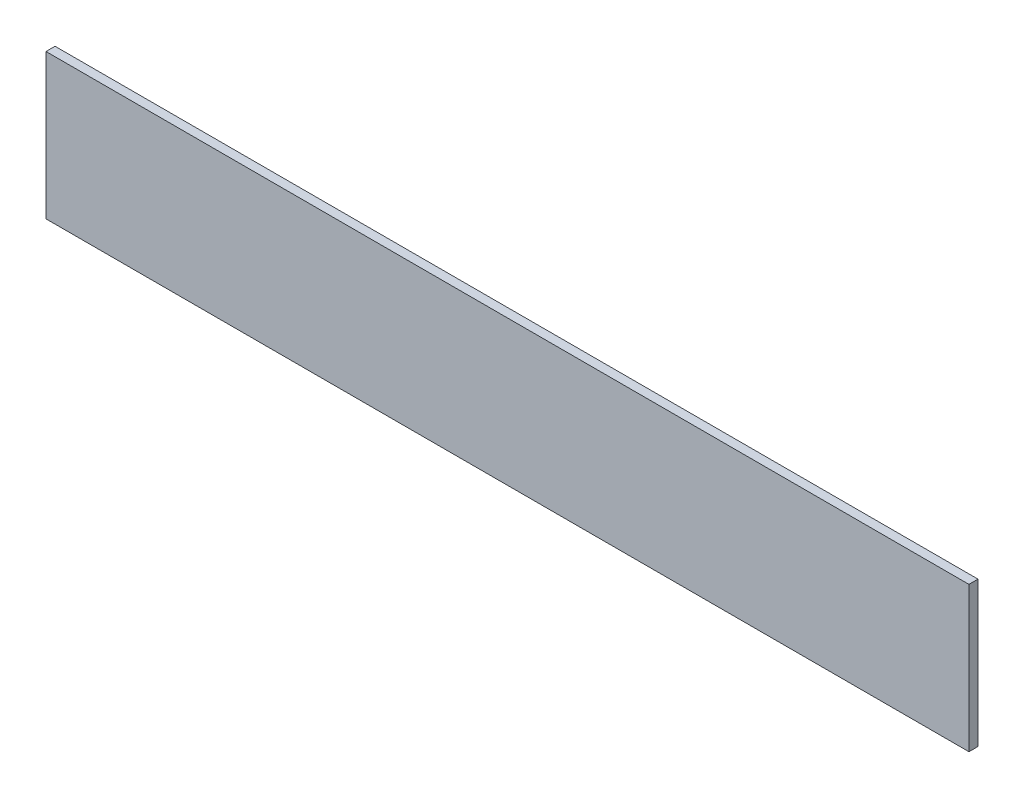
ISO-10303-21;
HEADER;
FILE_DESCRIPTION(('STEP AP214'),'2;1');
FILE_NAME('part.step','',(''),(''),'','','');
FILE_SCHEMA(('AUTOMOTIVE_DESIGN { 1 0 10303 214 1 1 1 1 }'));
ENDSEC;
DATA;
#1=APPLICATION_CONTEXT('core data for automotive mechanical design processes');
#2=APPLICATION_PROTOCOL_DEFINITION('international standard','automotive_design',2000,#1);
#3=PRODUCT_CONTEXT('',#1,'mechanical');
#4=PRODUCT('Part','Part','',(#3));
#5=PRODUCT_RELATED_PRODUCT_CATEGORY('part','',(#4));
#6=PRODUCT_DEFINITION_FORMATION('','',#4);
#7=PRODUCT_DEFINITION_CONTEXT('part definition',#1,'design');
#8=PRODUCT_DEFINITION('design','',#6,#7);
#9=PRODUCT_DEFINITION_SHAPE('','',#8);
#10=(LENGTH_UNIT() NAMED_UNIT(*) SI_UNIT(.MILLI.,.METRE.));
#11=(NAMED_UNIT(*) PLANE_ANGLE_UNIT() SI_UNIT($,.RADIAN.));
#12=(NAMED_UNIT(*) SI_UNIT($,.STERADIAN.) SOLID_ANGLE_UNIT());
#13=UNCERTAINTY_MEASURE_WITH_UNIT(LENGTH_MEASURE(1.E-05),#10,'distance_accuracy_value','');
#14=(GEOMETRIC_REPRESENTATION_CONTEXT(3) GLOBAL_UNCERTAINTY_ASSIGNED_CONTEXT((#13)) GLOBAL_UNIT_ASSIGNED_CONTEXT((#10,
#11,#12)) REPRESENTATION_CONTEXT('',''));
#15=CARTESIAN_POINT('',(0.,0.,0.));
#16=DIRECTION('',(0.,0.,1.));
#17=DIRECTION('',(1.,0.,0.));
#18=AXIS2_PLACEMENT_3D('',#15,#16,#17);
#19=CARTESIAN_POINT('',(0.,0.,6.35));
#20=DIRECTION('',(1.,0.,0.));
#21=DIRECTION('',(0.,0.,-1.));
#22=AXIS2_PLACEMENT_3D('',#19,#20,#21);
#23=PLANE('',#22);
#24=DIRECTION('',(0.,-1.,0.));
#25=VECTOR('',#24,1.);
#26=CARTESIAN_POINT('',(0.,0.,0.));
#27=LINE('',#26,#25);
#28=CARTESIAN_POINT('',(0.,101.6,0.));
#29=VERTEX_POINT('',#28);
#30=CARTESIAN_POINT('',(0.,0.,0.));
#31=VERTEX_POINT('',#30);
#32=EDGE_CURVE('E96',#29,#31,#27,.T.);
#33=ORIENTED_EDGE('',*,*,#32,.T.);
#34=DIRECTION('',(0.,0.,-1.));
#35=VECTOR('',#34,1.);
#36=CARTESIAN_POINT('',(0.,0.,6.35));
#37=LINE('',#36,#35);
#38=CARTESIAN_POINT('',(0.,0.,6.35));
#39=VERTEX_POINT('',#38);
#40=EDGE_CURVE('E11',#39,#31,#37,.T.);
#41=ORIENTED_EDGE('',*,*,#40,.F.);
#42=DIRECTION('',(0.,-1.,0.));
#43=VECTOR('',#42,1.);
#44=CARTESIAN_POINT('',(0.,0.,6.35));
#45=LINE('',#44,#43);
#46=CARTESIAN_POINT('',(0.,101.6,6.35));
#47=VERTEX_POINT('',#46);
#48=EDGE_CURVE('E84',#47,#39,#45,.T.);
#49=ORIENTED_EDGE('',*,*,#48,.F.);
#50=DIRECTION('',(0.,0.,-1.));
#51=VECTOR('',#50,1.);
#52=CARTESIAN_POINT('',(0.,101.6,6.35));
#53=LINE('',#52,#51);
#54=EDGE_CURVE('E92',#47,#29,#53,.T.);
#55=ORIENTED_EDGE('',*,*,#54,.T.);
#56=EDGE_LOOP('',(#33,#41,#49,#55));
#57=FACE_BOUND('',#56,.T.);
#58=ADVANCED_FACE('F33',(#57),#23,.F.);
#59=CARTESIAN_POINT('',(0.,0.,6.35));
#60=DIRECTION('',(0.,1.,0.));
#61=DIRECTION('',(0.,0.,1.));
#62=AXIS2_PLACEMENT_3D('',#59,#60,#61);
#63=PLANE('',#62);
#64=DIRECTION('',(1.,0.,0.));
#65=VECTOR('',#64,1.);
#66=CARTESIAN_POINT('',(0.,0.,0.));
#67=LINE('',#66,#65);
#68=CARTESIAN_POINT('',(646.866076921003,0.,0.));
#69=VERTEX_POINT('',#68);
#70=EDGE_CURVE('E88',#31,#69,#67,.T.);
#71=ORIENTED_EDGE('',*,*,#70,.T.);
#72=DIRECTION('',(0.,0.,-1.));
#73=VECTOR('',#72,1.);
#74=CARTESIAN_POINT('',(646.866076921003,0.,6.35));
#75=LINE('',#74,#73);
#76=CARTESIAN_POINT('',(646.866076921003,0.,6.35));
#77=VERTEX_POINT('',#76);
#78=EDGE_CURVE('E41',#77,#69,#75,.T.);
#79=ORIENTED_EDGE('',*,*,#78,.F.);
#80=DIRECTION('',(1.,0.,0.));
#81=VECTOR('',#80,1.);
#82=CARTESIAN_POINT('',(0.,0.,6.35));
#83=LINE('',#82,#81);
#84=EDGE_CURVE('E79',#39,#77,#83,.T.);
#85=ORIENTED_EDGE('',*,*,#84,.F.);
#86=ORIENTED_EDGE('',*,*,#40,.T.);
#87=EDGE_LOOP('',(#71,#79,#85,#86));
#88=FACE_BOUND('',#87,.T.);
#89=ADVANCED_FACE('F87',(#88),#63,.F.);
#90=CARTESIAN_POINT('',(646.866076921003,0.,6.35));
#91=DIRECTION('',(-1.,0.,0.));
#92=DIRECTION('',(0.,0.,1.));
#93=AXIS2_PLACEMENT_3D('',#90,#91,#92);
#94=PLANE('',#93);
#95=DIRECTION('',(0.,1.,0.));
#96=VECTOR('',#95,1.);
#97=CARTESIAN_POINT('',(646.866076921003,0.,0.));
#98=LINE('',#97,#96);
#99=CARTESIAN_POINT('',(646.866076921003,101.6,0.));
#100=VERTEX_POINT('',#99);
#101=EDGE_CURVE('E66',#69,#100,#98,.T.);
#102=ORIENTED_EDGE('',*,*,#101,.T.);
#103=DIRECTION('',(0.,0.,-1.));
#104=VECTOR('',#103,1.);
#105=CARTESIAN_POINT('',(646.866076921003,101.6,6.35));
#106=LINE('',#105,#104);
#107=CARTESIAN_POINT('',(646.866076921003,101.6,6.35));
#108=VERTEX_POINT('',#107);
#109=EDGE_CURVE('E89',#108,#100,#106,.T.);
#110=ORIENTED_EDGE('',*,*,#109,.F.);
#111=DIRECTION('',(0.,1.,0.));
#112=VECTOR('',#111,1.);
#113=CARTESIAN_POINT('',(646.866076921003,0.,6.35));
#114=LINE('',#113,#112);
#115=EDGE_CURVE('E82',#77,#108,#114,.T.);
#116=ORIENTED_EDGE('',*,*,#115,.F.);
#117=ORIENTED_EDGE('',*,*,#78,.T.);
#118=EDGE_LOOP('',(#102,#110,#116,#117));
#119=FACE_BOUND('',#118,.T.);
#120=ADVANCED_FACE('F90',(#119),#94,.F.);
#121=CARTESIAN_POINT('',(0.,101.6,6.35));
#122=DIRECTION('',(0.,-1.,0.));
#123=DIRECTION('',(0.,0.,-1.));
#124=AXIS2_PLACEMENT_3D('',#121,#122,#123);
#125=PLANE('',#124);
#126=DIRECTION('',(-1.,0.,0.));
#127=VECTOR('',#126,1.);
#128=CARTESIAN_POINT('',(0.,101.6,0.));
#129=LINE('',#128,#127);
#130=EDGE_CURVE('E72',#100,#29,#129,.T.);
#131=ORIENTED_EDGE('',*,*,#130,.T.);
#132=ORIENTED_EDGE('',*,*,#54,.F.);
#133=DIRECTION('',(-1.,0.,0.));
#134=VECTOR('',#133,1.);
#135=CARTESIAN_POINT('',(0.,101.6,6.35));
#136=LINE('',#135,#134);
#137=EDGE_CURVE('E49',#108,#47,#136,.T.);
#138=ORIENTED_EDGE('',*,*,#137,.F.);
#139=ORIENTED_EDGE('',*,*,#109,.T.);
#140=EDGE_LOOP('',(#131,#132,#138,#139));
#141=FACE_BOUND('',#140,.T.);
#142=ADVANCED_FACE('F103',(#141),#125,.F.);
#143=CARTESIAN_POINT('',(0.,0.,6.35));
#144=DIRECTION('',(0.,0.,-1.));
#145=DIRECTION('',(-1.,0.,0.));
#146=AXIS2_PLACEMENT_3D('',#143,#144,#145);
#147=PLANE('',#146);
#148=ORIENTED_EDGE('',*,*,#48,.T.);
#149=ORIENTED_EDGE('',*,*,#84,.T.);
#150=ORIENTED_EDGE('',*,*,#115,.T.);
#151=ORIENTED_EDGE('',*,*,#137,.T.);
#152=EDGE_LOOP('',(#148,#149,#150,#151));
#153=FACE_BOUND('',#152,.T.);
#154=ADVANCED_FACE('F80',(#153),#147,.F.);
#155=CARTESIAN_POINT('',(0.,0.,0.));
#156=DIRECTION('',(0.,0.,-1.));
#157=DIRECTION('',(-1.,0.,0.));
#158=AXIS2_PLACEMENT_3D('',#155,#156,#157);
#159=PLANE('',#158);
#160=ORIENTED_EDGE('',*,*,#32,.F.);
#161=ORIENTED_EDGE('',*,*,#130,.F.);
#162=ORIENTED_EDGE('',*,*,#101,.F.);
#163=ORIENTED_EDGE('',*,*,#70,.F.);
#164=EDGE_LOOP('',(#160,#161,#162,#163));
#165=FACE_BOUND('',#164,.T.);
#166=ADVANCED_FACE('F106',(#165),#159,.T.);
#167=CLOSED_SHELL('',(#58,#89,#120,#142,#154,#166));
#168=MANIFOLD_SOLID_BREP('B2',#167);
#169=ADVANCED_BREP_SHAPE_REPRESENTATION('',(#18,#168),#14);
#170=SHAPE_DEFINITION_REPRESENTATION(#9,#169);
ENDSEC;
END-ISO-10303-21;
